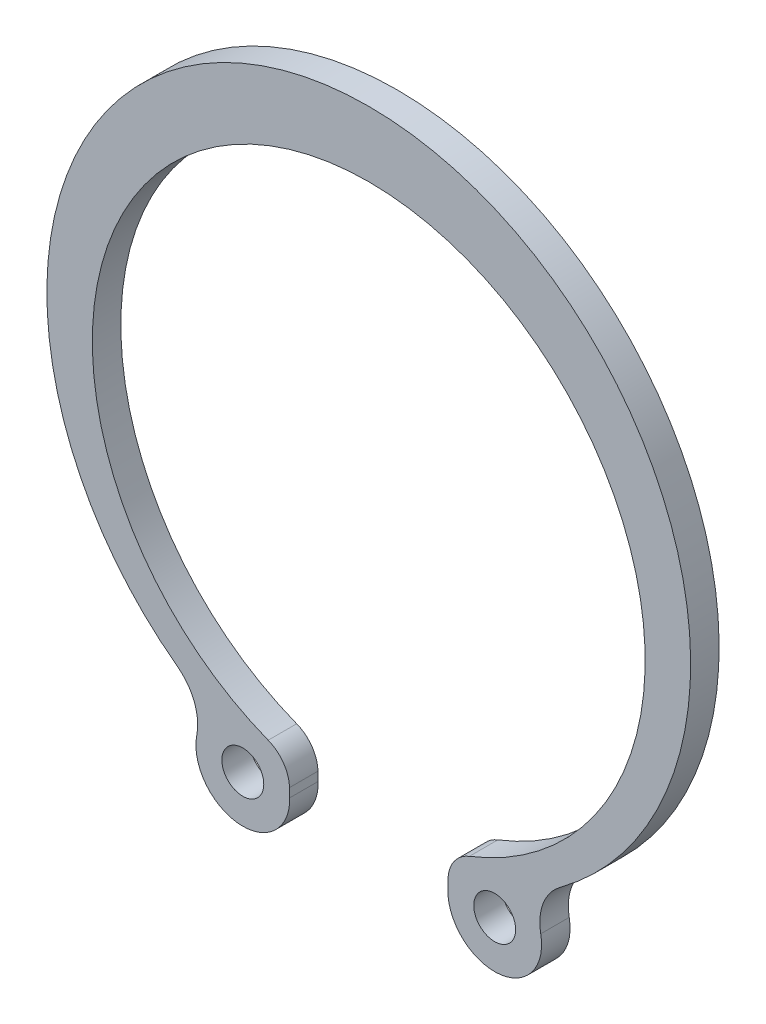
ISO-10303-21;
HEADER;
FILE_DESCRIPTION(('STEP AP214'),'2;1');
FILE_NAME('part.step','',(''),(''),'','','');
FILE_SCHEMA(('AUTOMOTIVE_DESIGN { 1 0 10303 214 1 1 1 1 }'));
ENDSEC;
DATA;
#1=APPLICATION_CONTEXT('core data for automotive mechanical design processes');
#2=APPLICATION_PROTOCOL_DEFINITION('international standard','automotive_design',2000,#1);
#3=PRODUCT_CONTEXT('',#1,'mechanical');
#4=PRODUCT('Part','Part','',(#3));
#5=PRODUCT_RELATED_PRODUCT_CATEGORY('part','',(#4));
#6=PRODUCT_DEFINITION_FORMATION('','',#4);
#7=PRODUCT_DEFINITION_CONTEXT('part definition',#1,'design');
#8=PRODUCT_DEFINITION('design','',#6,#7);
#9=PRODUCT_DEFINITION_SHAPE('','',#8);
#10=(LENGTH_UNIT() NAMED_UNIT(*) SI_UNIT(.MILLI.,.METRE.));
#11=(NAMED_UNIT(*) PLANE_ANGLE_UNIT() SI_UNIT($,.RADIAN.));
#12=(NAMED_UNIT(*) SI_UNIT($,.STERADIAN.) SOLID_ANGLE_UNIT());
#13=UNCERTAINTY_MEASURE_WITH_UNIT(LENGTH_MEASURE(1.E-05),#10,'distance_accuracy_value','');
#14=(GEOMETRIC_REPRESENTATION_CONTEXT(3) GLOBAL_UNCERTAINTY_ASSIGNED_CONTEXT((#13)) GLOBAL_UNIT_ASSIGNED_CONTEXT((#10,
#11,#12)) REPRESENTATION_CONTEXT('',''));
#15=CARTESIAN_POINT('',(0.,0.,0.));
#16=DIRECTION('',(0.,0.,1.));
#17=DIRECTION('',(1.,0.,0.));
#18=AXIS2_PLACEMENT_3D('',#15,#16,#17);
#19=CARTESIAN_POINT('',(0.,0.,1.7));
#20=DIRECTION('',(0.,0.,1.));
#21=DIRECTION('',(1.,0.,0.));
#22=AXIS2_PLACEMENT_3D('',#19,#20,#21);
#23=PLANE('',#22);
#24=CARTESIAN_POINT('',(0.,0.,1.7));
#25=DIRECTION('',(0.,0.,-1.));
#26=DIRECTION('',(1.,0.,0.));
#27=AXIS2_PLACEMENT_3D('',#24,#25,#26);
#28=CIRCLE('',#27,16.5);
#29=CARTESIAN_POINT('',(-6.00258346267833,-15.3694174181581,1.7));
#30=VERTEX_POINT('',#29);
#31=CARTESIAN_POINT('',(6.00258346267833,-15.3694174181581,1.7));
#32=VERTEX_POINT('',#31);
#33=EDGE_CURVE('E129',#30,#32,#28,.T.);
#34=ORIENTED_EDGE('',*,*,#33,.T.);
#35=CARTESIAN_POINT('',(6.73016933694237,-17.2323771052075,1.7));
#36=DIRECTION('',(0.,0.,-1.));
#37=DIRECTION('',(1.,0.,0.));
#38=AXIS2_PLACEMENT_3D('',#35,#36,#37);
#39=CIRCLE('',#38,2.);
#40=CARTESIAN_POINT('',(4.73078224602856,-17.1828668972984,1.7));
#41=VERTEX_POINT('',#40);
#42=EDGE_CURVE('E154',#41,#32,#39,.T.);
#43=ORIENTED_EDGE('',*,*,#42,.F.);
#44=DIRECTION('',(0.0247551039545473,0.999693545456906,0.));
#45=VECTOR('',#44,1.);
#46=CARTESIAN_POINT('',(4.73078224602856,-17.1828668972984,1.7));
#47=LINE('',#46,#45);
#48=CARTESIAN_POINT('',(4.71781588347628,-17.7064918021005,1.7));
#49=VERTEX_POINT('',#48);
#50=EDGE_CURVE('E160',#49,#41,#47,.T.);
#51=ORIENTED_EDGE('',*,*,#50,.F.);
#52=CARTESIAN_POINT('',(7.51695353766582,-17.7759784403721,1.7));
#53=DIRECTION('',(0.,0.,-1.));
#54=DIRECTION('',(-1.,0.,0.));
#55=AXIS2_PLACEMENT_3D('',#52,#53,#54);
#56=CIRCLE('',#55,2.8);
#57=CARTESIAN_POINT('',(10.2656813339434,-17.2425972427556,1.7));
#58=VERTEX_POINT('',#57);
#59=EDGE_CURVE('E200',#58,#49,#56,.T.);
#60=ORIENTED_EDGE('',*,*,#59,.F.);
#61=CARTESIAN_POINT('',(13.2107468299551,-16.6711173881664,1.7));
#62=DIRECTION('',(0.,0.,1.));
#63=DIRECTION('',(-1.,0.,0.));
#64=AXIS2_PLACEMENT_3D('',#61,#62,#63);
#65=CIRCLE('',#64,3.);
#66=CARTESIAN_POINT('',(11.4265744299925,-14.2593278353216,1.7));
#67=VERTEX_POINT('',#66);
#68=EDGE_CURVE('E202',#67,#58,#65,.T.);
#69=ORIENTED_EDGE('',*,*,#68,.F.);
#70=CARTESIAN_POINT('',(0.,1.18676517432095,1.7));
#71=DIRECTION('',(0.,0.,1.));
#72=DIRECTION('',(1.,0.,0.));
#73=AXIS2_PLACEMENT_3D('',#70,#71,#72);
#74=CIRCLE('',#73,19.213234825679);
#75=CARTESIAN_POINT('',(-11.4265744299925,-14.2593278353216,1.7));
#76=VERTEX_POINT('',#75);
#77=EDGE_CURVE('E87',#67,#76,#74,.T.);
#78=ORIENTED_EDGE('',*,*,#77,.T.);
#79=CARTESIAN_POINT('',(-13.2107468299551,-16.6711173881664,1.7));
#80=DIRECTION('',(0.,0.,-1.));
#81=DIRECTION('',(1.,0.,0.));
#82=AXIS2_PLACEMENT_3D('',#79,#80,#81);
#83=CIRCLE('',#82,3.);
#84=CARTESIAN_POINT('',(-10.2656813339434,-17.2425972427556,1.7));
#85=VERTEX_POINT('',#84);
#86=EDGE_CURVE('E101',#76,#85,#83,.T.);
#87=ORIENTED_EDGE('',*,*,#86,.T.);
#88=CARTESIAN_POINT('',(-7.51695353766582,-17.7759784403721,1.7));
#89=DIRECTION('',(0.,0.,1.));
#90=DIRECTION('',(1.,0.,0.));
#91=AXIS2_PLACEMENT_3D('',#88,#89,#90);
#92=CIRCLE('',#91,2.8);
#93=CARTESIAN_POINT('',(-4.71781588347628,-17.7064918021005,1.7));
#94=VERTEX_POINT('',#93);
#95=EDGE_CURVE('E95',#85,#94,#92,.T.);
#96=ORIENTED_EDGE('',*,*,#95,.T.);
#97=DIRECTION('',(-0.0247551039545473,0.999693545456906,0.));
#98=VECTOR('',#97,1.);
#99=CARTESIAN_POINT('',(-4.73078224602856,-17.1828668972984,1.7));
#100=LINE('',#99,#98);
#101=CARTESIAN_POINT('',(-4.73078224602856,-17.1828668972984,1.7));
#102=VERTEX_POINT('',#101);
#103=EDGE_CURVE('E99',#94,#102,#100,.T.);
#104=ORIENTED_EDGE('',*,*,#103,.T.);
#105=CARTESIAN_POINT('',(-6.73016933694237,-17.2323771052075,1.7));
#106=DIRECTION('',(0.,0.,1.));
#107=DIRECTION('',(-1.,0.,0.));
#108=AXIS2_PLACEMENT_3D('',#105,#106,#107);
#109=CIRCLE('',#108,2.);
#110=EDGE_CURVE('E52',#102,#30,#109,.T.);
#111=ORIENTED_EDGE('',*,*,#110,.T.);
#112=EDGE_LOOP('',(#34,#43,#51,#60,#69,#78,#87,#96,#104,#111));
#113=FACE_BOUND('',#112,.T.);
#114=CARTESIAN_POINT('',(-7.51695353766582,-17.7759784403721,1.7));
#115=DIRECTION('',(0.,0.,1.));
#116=DIRECTION('',(1.,0.,0.));
#117=AXIS2_PLACEMENT_3D('',#114,#115,#116);
#118=CIRCLE('',#117,1.25);
#119=CARTESIAN_POINT('',(-6.26695353766582,-17.7759784403721,1.7));
#120=VERTEX_POINT('',#119);
#121=EDGE_CURVE('E122',#120,#120,#118,.T.);
#122=ORIENTED_EDGE('',*,*,#121,.F.);
#123=EDGE_LOOP('',(#122));
#124=FACE_BOUND('',#123,.T.);
#125=CARTESIAN_POINT('',(7.51695353766582,-17.7759784403721,1.7));
#126=DIRECTION('',(0.,0.,-1.));
#127=DIRECTION('',(-1.,0.,0.));
#128=AXIS2_PLACEMENT_3D('',#125,#126,#127);
#129=CIRCLE('',#128,1.25);
#130=CARTESIAN_POINT('',(6.26695353766582,-17.7759784403721,1.7));
#131=VERTEX_POINT('',#130);
#132=EDGE_CURVE('E210',#131,#131,#129,.T.);
#133=ORIENTED_EDGE('',*,*,#132,.T.);
#134=EDGE_LOOP('',(#133));
#135=FACE_BOUND('',#134,.T.);
#136=ADVANCED_FACE('F35',(#113,#124,#135),#23,.T.);
#137=CARTESIAN_POINT('',(0.,0.,0.));
#138=DIRECTION('',(0.,0.,1.));
#139=DIRECTION('',(1.,0.,0.));
#140=AXIS2_PLACEMENT_3D('',#137,#138,#139);
#141=PLANE('',#140);
#142=CARTESIAN_POINT('',(0.,0.,0.));
#143=DIRECTION('',(0.,0.,-1.));
#144=DIRECTION('',(1.,0.,0.));
#145=AXIS2_PLACEMENT_3D('',#142,#143,#144);
#146=CIRCLE('',#145,16.5);
#147=CARTESIAN_POINT('',(-6.00258346267833,-15.3694174181581,0.));
#148=VERTEX_POINT('',#147);
#149=CARTESIAN_POINT('',(6.00258346267833,-15.3694174181581,0.));
#150=VERTEX_POINT('',#149);
#151=EDGE_CURVE('E118',#148,#150,#146,.T.);
#152=ORIENTED_EDGE('',*,*,#151,.F.);
#153=CARTESIAN_POINT('',(-6.73016933694237,-17.2323771052075,0.));
#154=DIRECTION('',(0.,0.,1.));
#155=DIRECTION('',(-1.,0.,0.));
#156=AXIS2_PLACEMENT_3D('',#153,#154,#155);
#157=CIRCLE('',#156,2.);
#158=CARTESIAN_POINT('',(-4.73078224602856,-17.1828668972984,0.));
#159=VERTEX_POINT('',#158);
#160=EDGE_CURVE('E79',#159,#148,#157,.T.);
#161=ORIENTED_EDGE('',*,*,#160,.F.);
#162=DIRECTION('',(-0.0247551039545473,0.999693545456906,0.));
#163=VECTOR('',#162,1.);
#164=CARTESIAN_POINT('',(-4.73078224602856,-17.1828668972984,0.));
#165=LINE('',#164,#163);
#166=CARTESIAN_POINT('',(-4.71781588347628,-17.7064918021005,0.));
#167=VERTEX_POINT('',#166);
#168=EDGE_CURVE('E73',#167,#159,#165,.T.);
#169=ORIENTED_EDGE('',*,*,#168,.F.);
#170=CARTESIAN_POINT('',(-7.51695353766582,-17.7759784403721,0.));
#171=DIRECTION('',(0.,0.,1.));
#172=DIRECTION('',(1.,0.,0.));
#173=AXIS2_PLACEMENT_3D('',#170,#171,#172);
#174=CIRCLE('',#173,2.8);
#175=CARTESIAN_POINT('',(-10.2656813339434,-17.2425972427556,0.));
#176=VERTEX_POINT('',#175);
#177=EDGE_CURVE('E109',#176,#167,#174,.T.);
#178=ORIENTED_EDGE('',*,*,#177,.F.);
#179=CARTESIAN_POINT('',(-13.2107468299551,-16.6711173881664,0.));
#180=DIRECTION('',(0.,0.,-1.));
#181=DIRECTION('',(1.,0.,0.));
#182=AXIS2_PLACEMENT_3D('',#179,#180,#181);
#183=CIRCLE('',#182,3.);
#184=CARTESIAN_POINT('',(-11.4265744299925,-14.2593278353216,0.));
#185=VERTEX_POINT('',#184);
#186=EDGE_CURVE('E124',#185,#176,#183,.T.);
#187=ORIENTED_EDGE('',*,*,#186,.F.);
#188=CARTESIAN_POINT('',(0.,1.18676517432095,0.));
#189=DIRECTION('',(0.,0.,1.));
#190=DIRECTION('',(1.,0.,0.));
#191=AXIS2_PLACEMENT_3D('',#188,#189,#190);
#192=CIRCLE('',#191,19.213234825679);
#193=CARTESIAN_POINT('',(11.4265744299925,-14.2593278353216,0.));
#194=VERTEX_POINT('',#193);
#195=EDGE_CURVE('E121',#194,#185,#192,.T.);
#196=ORIENTED_EDGE('',*,*,#195,.F.);
#197=CARTESIAN_POINT('',(13.2107468299551,-16.6711173881664,0.));
#198=DIRECTION('',(0.,0.,1.));
#199=DIRECTION('',(-1.,0.,0.));
#200=AXIS2_PLACEMENT_3D('',#197,#198,#199);
#201=CIRCLE('',#200,3.);
#202=CARTESIAN_POINT('',(10.2656813339434,-17.2425972427556,0.));
#203=VERTEX_POINT('',#202);
#204=EDGE_CURVE('E206',#194,#203,#201,.T.);
#205=ORIENTED_EDGE('',*,*,#204,.T.);
#206=CARTESIAN_POINT('',(7.51695353766582,-17.7759784403721,0.));
#207=DIRECTION('',(0.,0.,-1.));
#208=DIRECTION('',(-1.,0.,0.));
#209=AXIS2_PLACEMENT_3D('',#206,#207,#208);
#210=CIRCLE('',#209,2.8);
#211=CARTESIAN_POINT('',(4.71781588347628,-17.7064918021005,0.));
#212=VERTEX_POINT('',#211);
#213=EDGE_CURVE('E209',#203,#212,#210,.T.);
#214=ORIENTED_EDGE('',*,*,#213,.T.);
#215=DIRECTION('',(0.0247551039545473,0.999693545456906,0.));
#216=VECTOR('',#215,1.);
#217=CARTESIAN_POINT('',(4.73078224602856,-17.1828668972984,0.));
#218=LINE('',#217,#216);
#219=CARTESIAN_POINT('',(4.73078224602856,-17.1828668972984,0.));
#220=VERTEX_POINT('',#219);
#221=EDGE_CURVE('E196',#212,#220,#218,.T.);
#222=ORIENTED_EDGE('',*,*,#221,.T.);
#223=CARTESIAN_POINT('',(6.73016933694237,-17.2323771052075,0.));
#224=DIRECTION('',(0.,0.,-1.));
#225=DIRECTION('',(1.,0.,0.));
#226=AXIS2_PLACEMENT_3D('',#223,#224,#225);
#227=CIRCLE('',#226,2.);
#228=EDGE_CURVE('E141',#220,#150,#227,.T.);
#229=ORIENTED_EDGE('',*,*,#228,.T.);
#230=EDGE_LOOP('',(#152,#161,#169,#178,#187,#196,#205,#214,#222,#229));
#231=FACE_BOUND('',#230,.T.);
#232=CARTESIAN_POINT('',(-7.51695353766582,-17.7759784403721,0.));
#233=DIRECTION('',(0.,0.,1.));
#234=DIRECTION('',(1.,0.,0.));
#235=AXIS2_PLACEMENT_3D('',#232,#233,#234);
#236=CIRCLE('',#235,1.25);
#237=CARTESIAN_POINT('',(-6.26695353766582,-17.7759784403721,0.));
#238=VERTEX_POINT('',#237);
#239=EDGE_CURVE('E173',#238,#238,#236,.T.);
#240=ORIENTED_EDGE('',*,*,#239,.T.);
#241=EDGE_LOOP('',(#240));
#242=FACE_BOUND('',#241,.T.);
#243=CARTESIAN_POINT('',(7.51695353766582,-17.7759784403721,0.));
#244=DIRECTION('',(0.,0.,-1.));
#245=DIRECTION('',(-1.,0.,0.));
#246=AXIS2_PLACEMENT_3D('',#243,#244,#245);
#247=CIRCLE('',#246,1.25);
#248=CARTESIAN_POINT('',(6.26695353766582,-17.7759784403721,0.));
#249=VERTEX_POINT('',#248);
#250=EDGE_CURVE('E216',#249,#249,#247,.T.);
#251=ORIENTED_EDGE('',*,*,#250,.F.);
#252=EDGE_LOOP('',(#251));
#253=FACE_BOUND('',#252,.T.);
#254=ADVANCED_FACE('F135',(#231,#242,#253),#141,.F.);
#255=CARTESIAN_POINT('',(0.,0.,1.7));
#256=DIRECTION('',(0.,0.,-1.));
#257=DIRECTION('',(-1.,0.,0.));
#258=AXIS2_PLACEMENT_3D('',#255,#256,#257);
#259=CYLINDRICAL_SURFACE('',#258,16.5);
#260=ORIENTED_EDGE('',*,*,#151,.T.);
#261=DIRECTION('',(0.,0.,-1.));
#262=VECTOR('',#261,1.);
#263=CARTESIAN_POINT('',(6.00258346267833,-15.3694174181581,1.7));
#264=LINE('',#263,#262);
#265=EDGE_CURVE('E146',#32,#150,#264,.T.);
#266=ORIENTED_EDGE('',*,*,#265,.F.);
#267=ORIENTED_EDGE('',*,*,#33,.F.);
#268=DIRECTION('',(0.,0.,-1.));
#269=VECTOR('',#268,1.);
#270=CARTESIAN_POINT('',(-6.00258346267833,-15.3694174181581,1.7));
#271=LINE('',#270,#269);
#272=EDGE_CURVE('E114',#30,#148,#271,.T.);
#273=ORIENTED_EDGE('',*,*,#272,.T.);
#274=EDGE_LOOP('',(#260,#266,#267,#273));
#275=FACE_BOUND('',#274,.T.);
#276=ADVANCED_FACE('F37',(#275),#259,.F.);
#277=CARTESIAN_POINT('',(0.,1.18676517432095,1.7));
#278=DIRECTION('',(0.,0.,-1.));
#279=DIRECTION('',(-1.,0.,0.));
#280=AXIS2_PLACEMENT_3D('',#277,#278,#279);
#281=CYLINDRICAL_SURFACE('',#280,19.213234825679);
#282=ORIENTED_EDGE('',*,*,#195,.T.);
#283=DIRECTION('',(0.,0.,-1.));
#284=VECTOR('',#283,1.);
#285=CARTESIAN_POINT('',(-11.4265744299925,-14.2593278353216,1.7));
#286=LINE('',#285,#284);
#287=EDGE_CURVE('E11',#76,#185,#286,.T.);
#288=ORIENTED_EDGE('',*,*,#287,.F.);
#289=ORIENTED_EDGE('',*,*,#77,.F.);
#290=DIRECTION('',(0.,0.,-1.));
#291=VECTOR('',#290,1.);
#292=CARTESIAN_POINT('',(11.4265744299925,-14.2593278353216,1.7));
#293=LINE('',#292,#291);
#294=EDGE_CURVE('E170',#67,#194,#293,.T.);
#295=ORIENTED_EDGE('',*,*,#294,.T.);
#296=EDGE_LOOP('',(#282,#288,#289,#295));
#297=FACE_BOUND('',#296,.T.);
#298=ADVANCED_FACE('F235',(#297),#281,.T.);
#299=CARTESIAN_POINT('',(-13.2107468299551,-16.6711173881664,1.7));
#300=DIRECTION('',(0.,0.,-1.));
#301=DIRECTION('',(-1.,0.,0.));
#302=AXIS2_PLACEMENT_3D('',#299,#300,#301);
#303=CYLINDRICAL_SURFACE('',#302,3.);
#304=ORIENTED_EDGE('',*,*,#186,.T.);
#305=DIRECTION('',(0.,0.,-1.));
#306=VECTOR('',#305,1.);
#307=CARTESIAN_POINT('',(-10.2656813339434,-17.2425972427556,1.7));
#308=LINE('',#307,#306);
#309=EDGE_CURVE('E44',#85,#176,#308,.T.);
#310=ORIENTED_EDGE('',*,*,#309,.F.);
#311=ORIENTED_EDGE('',*,*,#86,.F.);
#312=ORIENTED_EDGE('',*,*,#287,.T.);
#313=EDGE_LOOP('',(#304,#310,#311,#312));
#314=FACE_BOUND('',#313,.T.);
#315=ADVANCED_FACE('F247',(#314),#303,.F.);
#316=CARTESIAN_POINT('',(-7.51695353766582,-17.7759784403721,1.7));
#317=DIRECTION('',(0.,0.,-1.));
#318=DIRECTION('',(-1.,0.,0.));
#319=AXIS2_PLACEMENT_3D('',#316,#317,#318);
#320=CYLINDRICAL_SURFACE('',#319,2.8);
#321=ORIENTED_EDGE('',*,*,#177,.T.);
#322=DIRECTION('',(0.,0.,-1.));
#323=VECTOR('',#322,1.);
#324=CARTESIAN_POINT('',(-4.71781588347628,-17.7064918021005,1.7));
#325=LINE('',#324,#323);
#326=EDGE_CURVE('E106',#94,#167,#325,.T.);
#327=ORIENTED_EDGE('',*,*,#326,.F.);
#328=ORIENTED_EDGE('',*,*,#95,.F.);
#329=ORIENTED_EDGE('',*,*,#309,.T.);
#330=EDGE_LOOP('',(#321,#327,#328,#329));
#331=FACE_BOUND('',#330,.T.);
#332=ADVANCED_FACE('F107',(#331),#320,.T.);
#333=CARTESIAN_POINT('',(-4.73078224602856,-17.1828668972984,1.7));
#334=DIRECTION('',(-0.999693545456906,-0.0247551039545473,0.));
#335=DIRECTION('',(0.0247551039545473,-0.999693545456906,0.));
#336=AXIS2_PLACEMENT_3D('',#333,#334,#335);
#337=PLANE('',#336);
#338=ORIENTED_EDGE('',*,*,#168,.T.);
#339=DIRECTION('',(0.,0.,-1.));
#340=VECTOR('',#339,1.);
#341=CARTESIAN_POINT('',(-4.73078224602856,-17.1828668972984,1.7));
#342=LINE('',#341,#340);
#343=EDGE_CURVE('E110',#102,#159,#342,.T.);
#344=ORIENTED_EDGE('',*,*,#343,.F.);
#345=ORIENTED_EDGE('',*,*,#103,.F.);
#346=ORIENTED_EDGE('',*,*,#326,.T.);
#347=EDGE_LOOP('',(#338,#344,#345,#346));
#348=FACE_BOUND('',#347,.T.);
#349=ADVANCED_FACE('F112',(#348),#337,.F.);
#350=CARTESIAN_POINT('',(-6.73016933694237,-17.2323771052075,1.7));
#351=DIRECTION('',(0.,0.,-1.));
#352=DIRECTION('',(-1.,0.,0.));
#353=AXIS2_PLACEMENT_3D('',#350,#351,#352);
#354=CYLINDRICAL_SURFACE('',#353,2.);
#355=ORIENTED_EDGE('',*,*,#160,.T.);
#356=ORIENTED_EDGE('',*,*,#272,.F.);
#357=ORIENTED_EDGE('',*,*,#110,.F.);
#358=ORIENTED_EDGE('',*,*,#343,.T.);
#359=EDGE_LOOP('',(#355,#356,#357,#358));
#360=FACE_BOUND('',#359,.T.);
#361=ADVANCED_FACE('F239',(#360),#354,.T.);
#362=CARTESIAN_POINT('',(-7.51695353766582,-17.7759784403721,1.7));
#363=DIRECTION('',(0.,0.,-1.));
#364=DIRECTION('',(-1.,0.,0.));
#365=AXIS2_PLACEMENT_3D('',#362,#363,#364);
#366=CYLINDRICAL_SURFACE('',#365,1.25);
#367=ORIENTED_EDGE('',*,*,#121,.T.);
#368=EDGE_LOOP('',(#367));
#369=FACE_BOUND('',#368,.T.);
#370=ORIENTED_EDGE('',*,*,#239,.F.);
#371=EDGE_LOOP('',(#370));
#372=FACE_BOUND('',#371,.T.);
#373=ADVANCED_FACE('F242',(#369,#372),#366,.F.);
#374=CARTESIAN_POINT('',(13.2107468299551,-16.6711173881664,1.7));
#375=DIRECTION('',(0.,0.,-1.));
#376=DIRECTION('',(1.,0.,0.));
#377=AXIS2_PLACEMENT_3D('',#374,#375,#376);
#378=CYLINDRICAL_SURFACE('',#377,3.);
#379=ORIENTED_EDGE('',*,*,#204,.F.);
#380=ORIENTED_EDGE('',*,*,#294,.F.);
#381=ORIENTED_EDGE('',*,*,#68,.T.);
#382=DIRECTION('',(0.,0.,-1.));
#383=VECTOR('',#382,1.);
#384=CARTESIAN_POINT('',(10.2656813339434,-17.2425972427556,1.7));
#385=LINE('',#384,#383);
#386=EDGE_CURVE('E167',#58,#203,#385,.T.);
#387=ORIENTED_EDGE('',*,*,#386,.T.);
#388=EDGE_LOOP('',(#379,#380,#381,#387));
#389=FACE_BOUND('',#388,.T.);
#390=ADVANCED_FACE('F255',(#389),#378,.F.);
#391=CARTESIAN_POINT('',(7.51695353766582,-17.7759784403721,1.7));
#392=DIRECTION('',(0.,0.,-1.));
#393=DIRECTION('',(1.,0.,0.));
#394=AXIS2_PLACEMENT_3D('',#391,#392,#393);
#395=CYLINDRICAL_SURFACE('',#394,2.8);
#396=ORIENTED_EDGE('',*,*,#213,.F.);
#397=ORIENTED_EDGE('',*,*,#386,.F.);
#398=ORIENTED_EDGE('',*,*,#59,.T.);
#399=DIRECTION('',(0.,0.,-1.));
#400=VECTOR('',#399,1.);
#401=CARTESIAN_POINT('',(4.71781588347628,-17.7064918021005,1.7));
#402=LINE('',#401,#400);
#403=EDGE_CURVE('E158',#49,#212,#402,.T.);
#404=ORIENTED_EDGE('',*,*,#403,.T.);
#405=EDGE_LOOP('',(#396,#397,#398,#404));
#406=FACE_BOUND('',#405,.T.);
#407=ADVANCED_FACE('F258',(#406),#395,.T.);
#408=CARTESIAN_POINT('',(4.73078224602856,-17.1828668972984,1.7));
#409=DIRECTION('',(0.999693545456906,-0.0247551039545473,0.));
#410=DIRECTION('',(-0.0247551039545473,-0.999693545456906,0.));
#411=AXIS2_PLACEMENT_3D('',#408,#409,#410);
#412=PLANE('',#411);
#413=ORIENTED_EDGE('',*,*,#221,.F.);
#414=ORIENTED_EDGE('',*,*,#403,.F.);
#415=ORIENTED_EDGE('',*,*,#50,.T.);
#416=DIRECTION('',(0.,0.,-1.));
#417=VECTOR('',#416,1.);
#418=CARTESIAN_POINT('',(4.73078224602856,-17.1828668972984,1.7));
#419=LINE('',#418,#417);
#420=EDGE_CURVE('E155',#41,#220,#419,.T.);
#421=ORIENTED_EDGE('',*,*,#420,.T.);
#422=EDGE_LOOP('',(#413,#414,#415,#421));
#423=FACE_BOUND('',#422,.T.);
#424=ADVANCED_FACE('F194',(#423),#412,.F.);
#425=CARTESIAN_POINT('',(6.73016933694237,-17.2323771052075,1.7));
#426=DIRECTION('',(0.,0.,-1.));
#427=DIRECTION('',(1.,0.,0.));
#428=AXIS2_PLACEMENT_3D('',#425,#426,#427);
#429=CYLINDRICAL_SURFACE('',#428,2.);
#430=ORIENTED_EDGE('',*,*,#228,.F.);
#431=ORIENTED_EDGE('',*,*,#420,.F.);
#432=ORIENTED_EDGE('',*,*,#42,.T.);
#433=ORIENTED_EDGE('',*,*,#265,.T.);
#434=EDGE_LOOP('',(#430,#431,#432,#433));
#435=FACE_BOUND('',#434,.T.);
#436=ADVANCED_FACE('F151',(#435),#429,.T.);
#437=CARTESIAN_POINT('',(7.51695353766582,-17.7759784403721,1.7));
#438=DIRECTION('',(0.,0.,-1.));
#439=DIRECTION('',(1.,0.,0.));
#440=AXIS2_PLACEMENT_3D('',#437,#438,#439);
#441=CYLINDRICAL_SURFACE('',#440,1.25);
#442=ORIENTED_EDGE('',*,*,#132,.F.);
#443=EDGE_LOOP('',(#442));
#444=FACE_BOUND('',#443,.T.);
#445=ORIENTED_EDGE('',*,*,#250,.T.);
#446=EDGE_LOOP('',(#445));
#447=FACE_BOUND('',#446,.T.);
#448=ADVANCED_FACE('F223',(#444,#447),#441,.F.);
#449=CLOSED_SHELL('',(#136,#254,#276,#298,#315,#332,#349,#361,#373,#390,#407,#424,#436,#448));
#450=MANIFOLD_SOLID_BREP('B2',#449);
#451=ADVANCED_BREP_SHAPE_REPRESENTATION('',(#18,#450),#14);
#452=SHAPE_DEFINITION_REPRESENTATION(#9,#451);
ENDSEC;
END-ISO-10303-21;
